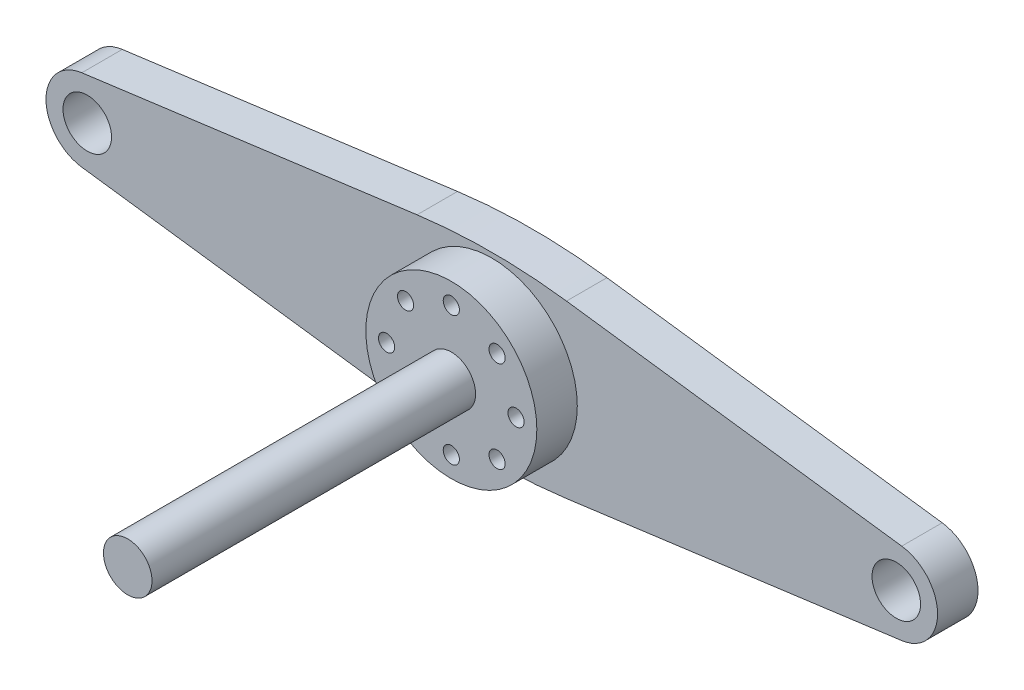
ISO-10303-21;
HEADER;
FILE_DESCRIPTION(('STEP AP214'),'2;1');
FILE_NAME('part.step','',(''),(''),'','','');
FILE_SCHEMA(('AUTOMOTIVE_DESIGN { 1 0 10303 214 1 1 1 1 }'));
ENDSEC;
DATA;
#1=APPLICATION_CONTEXT('core data for automotive mechanical design processes');
#2=APPLICATION_PROTOCOL_DEFINITION('international standard','automotive_design',2000,#1);
#3=PRODUCT_CONTEXT('',#1,'mechanical');
#4=PRODUCT('Part','Part','',(#3));
#5=PRODUCT_RELATED_PRODUCT_CATEGORY('part','',(#4));
#6=PRODUCT_DEFINITION_FORMATION('','',#4);
#7=PRODUCT_DEFINITION_CONTEXT('part definition',#1,'design');
#8=PRODUCT_DEFINITION('design','',#6,#7);
#9=PRODUCT_DEFINITION_SHAPE('','',#8);
#10=(LENGTH_UNIT() NAMED_UNIT(*) SI_UNIT(.MILLI.,.METRE.));
#11=(NAMED_UNIT(*) PLANE_ANGLE_UNIT() SI_UNIT($,.RADIAN.));
#12=(NAMED_UNIT(*) SI_UNIT($,.STERADIAN.) SOLID_ANGLE_UNIT());
#13=UNCERTAINTY_MEASURE_WITH_UNIT(LENGTH_MEASURE(1.E-05),#10,'distance_accuracy_value','');
#14=(GEOMETRIC_REPRESENTATION_CONTEXT(3) GLOBAL_UNCERTAINTY_ASSIGNED_CONTEXT((#13)) GLOBAL_UNIT_ASSIGNED_CONTEXT((#10,
#11,#12)) REPRESENTATION_CONTEXT('',''));
#15=CARTESIAN_POINT('',(0.,0.,0.));
#16=DIRECTION('',(0.,0.,1.));
#17=DIRECTION('',(1.,0.,0.));
#18=AXIS2_PLACEMENT_3D('',#15,#16,#17);
#19=CARTESIAN_POINT('',(-5.65685424949245,-5.65685424949231,5.));
#20=DIRECTION('',(0.,0.,-1.));
#21=DIRECTION('',(-1.,0.,0.));
#22=AXIS2_PLACEMENT_3D('',#19,#20,#21);
#23=CYLINDRICAL_SURFACE('',#22,1.);
#24=CARTESIAN_POINT('',(-5.65685424949245,-5.65685424949231,0.));
#25=DIRECTION('',(0.,0.,1.));
#26=DIRECTION('',(1.,0.,0.));
#27=AXIS2_PLACEMENT_3D('',#24,#25,#26);
#28=CIRCLE('',#27,1.);
#29=CARTESIAN_POINT('',(-4.65685424949245,-5.65685424949231,0.));
#30=VERTEX_POINT('',#29);
#31=EDGE_CURVE('E204',#30,#30,#28,.T.);
#32=ORIENTED_EDGE('',*,*,#31,.F.);
#33=EDGE_LOOP('',(#32));
#34=FACE_BOUND('',#33,.T.);
#35=CARTESIAN_POINT('',(-5.65685424949245,-5.65685424949231,10.));
#36=DIRECTION('',(0.,0.,1.));
#37=DIRECTION('',(1.,0.,0.));
#38=AXIS2_PLACEMENT_3D('',#35,#36,#37);
#39=CIRCLE('',#38,1.);
#40=CARTESIAN_POINT('',(-4.65685424949245,-5.65685424949231,10.));
#41=VERTEX_POINT('',#40);
#42=EDGE_CURVE('E247',#41,#41,#39,.T.);
#43=ORIENTED_EDGE('',*,*,#42,.T.);
#44=EDGE_LOOP('',(#43));
#45=FACE_BOUND('',#44,.T.);
#46=ADVANCED_FACE('F61',(#34,#45),#23,.F.);
#47=CARTESIAN_POINT('',(0.,-8.,5.));
#48=DIRECTION('',(0.,0.,-1.));
#49=DIRECTION('',(-1.,0.,0.));
#50=AXIS2_PLACEMENT_3D('',#47,#48,#49);
#51=CYLINDRICAL_SURFACE('',#50,1.);
#52=CARTESIAN_POINT('',(0.,-8.,0.));
#53=DIRECTION('',(0.,0.,1.));
#54=DIRECTION('',(1.,0.,0.));
#55=AXIS2_PLACEMENT_3D('',#52,#53,#54);
#56=CIRCLE('',#55,1.);
#57=CARTESIAN_POINT('',(0.999999999999915,-8.,0.));
#58=VERTEX_POINT('',#57);
#59=EDGE_CURVE('E201',#58,#58,#56,.T.);
#60=ORIENTED_EDGE('',*,*,#59,.F.);
#61=EDGE_LOOP('',(#60));
#62=FACE_BOUND('',#61,.T.);
#63=CARTESIAN_POINT('',(0.,-8.,10.));
#64=DIRECTION('',(0.,0.,1.));
#65=DIRECTION('',(1.,0.,0.));
#66=AXIS2_PLACEMENT_3D('',#63,#64,#65);
#67=CIRCLE('',#66,1.);
#68=CARTESIAN_POINT('',(0.999999999999915,-8.,10.));
#69=VERTEX_POINT('',#68);
#70=EDGE_CURVE('E250',#69,#69,#67,.T.);
#71=ORIENTED_EDGE('',*,*,#70,.T.);
#72=EDGE_LOOP('',(#71));
#73=FACE_BOUND('',#72,.T.);
#74=ADVANCED_FACE('F294',(#62,#73),#51,.F.);
#75=CARTESIAN_POINT('',(5.65685424949233,-5.65685424949243,5.));
#76=DIRECTION('',(0.,0.,-1.));
#77=DIRECTION('',(-1.,0.,0.));
#78=AXIS2_PLACEMENT_3D('',#75,#76,#77);
#79=CYLINDRICAL_SURFACE('',#78,1.);
#80=CARTESIAN_POINT('',(5.65685424949233,-5.65685424949243,0.));
#81=DIRECTION('',(0.,0.,1.));
#82=DIRECTION('',(1.,0.,0.));
#83=AXIS2_PLACEMENT_3D('',#80,#81,#82);
#84=CIRCLE('',#83,1.);
#85=CARTESIAN_POINT('',(6.65685424949233,-5.65685424949243,0.));
#86=VERTEX_POINT('',#85);
#87=EDGE_CURVE('E198',#86,#86,#84,.T.);
#88=ORIENTED_EDGE('',*,*,#87,.F.);
#89=EDGE_LOOP('',(#88));
#90=FACE_BOUND('',#89,.T.);
#91=CARTESIAN_POINT('',(5.65685424949233,-5.65685424949243,10.));
#92=DIRECTION('',(0.,0.,1.));
#93=DIRECTION('',(1.,0.,0.));
#94=AXIS2_PLACEMENT_3D('',#91,#92,#93);
#95=CIRCLE('',#94,1.);
#96=CARTESIAN_POINT('',(6.65685424949233,-5.65685424949243,10.));
#97=VERTEX_POINT('',#96);
#98=EDGE_CURVE('E253',#97,#97,#95,.T.);
#99=ORIENTED_EDGE('',*,*,#98,.T.);
#100=EDGE_LOOP('',(#99));
#101=FACE_BOUND('',#100,.T.);
#102=ADVANCED_FACE('F300',(#90,#101),#79,.F.);
#103=CARTESIAN_POINT('',(8.,0.,5.));
#104=DIRECTION('',(0.,0.,-1.));
#105=DIRECTION('',(-1.,0.,0.));
#106=AXIS2_PLACEMENT_3D('',#103,#104,#105);
#107=CYLINDRICAL_SURFACE('',#106,0.999999999999999);
#108=CARTESIAN_POINT('',(8.,0.,0.));
#109=DIRECTION('',(0.,0.,1.));
#110=DIRECTION('',(1.,0.,0.));
#111=AXIS2_PLACEMENT_3D('',#108,#109,#110);
#112=CIRCLE('',#111,0.999999999999999);
#113=CARTESIAN_POINT('',(9.,0.,0.));
#114=VERTEX_POINT('',#113);
#115=EDGE_CURVE('E195',#114,#114,#112,.T.);
#116=ORIENTED_EDGE('',*,*,#115,.F.);
#117=EDGE_LOOP('',(#116));
#118=FACE_BOUND('',#117,.T.);
#119=CARTESIAN_POINT('',(8.,0.,10.));
#120=DIRECTION('',(0.,0.,1.));
#121=DIRECTION('',(1.,0.,0.));
#122=AXIS2_PLACEMENT_3D('',#119,#120,#121);
#123=CIRCLE('',#122,0.999999999999999);
#124=CARTESIAN_POINT('',(9.,0.,10.));
#125=VERTEX_POINT('',#124);
#126=EDGE_CURVE('E256',#125,#125,#123,.T.);
#127=ORIENTED_EDGE('',*,*,#126,.T.);
#128=EDGE_LOOP('',(#127));
#129=FACE_BOUND('',#128,.T.);
#130=ADVANCED_FACE('F310',(#118,#129),#107,.F.);
#131=CARTESIAN_POINT('',(5.65685424949241,5.65685424949235,5.));
#132=DIRECTION('',(0.,0.,-1.));
#133=DIRECTION('',(-1.,0.,0.));
#134=AXIS2_PLACEMENT_3D('',#131,#132,#133);
#135=CYLINDRICAL_SURFACE('',#134,0.999999999999999);
#136=CARTESIAN_POINT('',(5.65685424949241,5.65685424949235,0.));
#137=DIRECTION('',(0.,0.,1.));
#138=DIRECTION('',(1.,0.,0.));
#139=AXIS2_PLACEMENT_3D('',#136,#137,#138);
#140=CIRCLE('',#139,0.999999999999999);
#141=CARTESIAN_POINT('',(6.65685424949241,5.65685424949235,0.));
#142=VERTEX_POINT('',#141);
#143=EDGE_CURVE('E192',#142,#142,#140,.T.);
#144=ORIENTED_EDGE('',*,*,#143,.F.);
#145=EDGE_LOOP('',(#144));
#146=FACE_BOUND('',#145,.T.);
#147=CARTESIAN_POINT('',(5.65685424949241,5.65685424949235,10.));
#148=DIRECTION('',(0.,0.,1.));
#149=DIRECTION('',(1.,0.,0.));
#150=AXIS2_PLACEMENT_3D('',#147,#148,#149);
#151=CIRCLE('',#150,0.999999999999999);
#152=CARTESIAN_POINT('',(6.65685424949241,5.65685424949235,10.));
#153=VERTEX_POINT('',#152);
#154=EDGE_CURVE('E259',#153,#153,#151,.T.);
#155=ORIENTED_EDGE('',*,*,#154,.T.);
#156=EDGE_LOOP('',(#155));
#157=FACE_BOUND('',#156,.T.);
#158=ADVANCED_FACE('F314',(#146,#157),#135,.F.);
#159=CARTESIAN_POINT('',(0.,8.,5.));
#160=DIRECTION('',(0.,0.,-1.));
#161=DIRECTION('',(-1.,0.,0.));
#162=AXIS2_PLACEMENT_3D('',#159,#160,#161);
#163=CYLINDRICAL_SURFACE('',#162,1.);
#164=CARTESIAN_POINT('',(0.,8.,0.));
#165=DIRECTION('',(0.,0.,1.));
#166=DIRECTION('',(1.,0.,0.));
#167=AXIS2_PLACEMENT_3D('',#164,#165,#166);
#168=CIRCLE('',#167,1.);
#169=CARTESIAN_POINT('',(1.00000000000003,8.,0.));
#170=VERTEX_POINT('',#169);
#171=EDGE_CURVE('E189',#170,#170,#168,.T.);
#172=ORIENTED_EDGE('',*,*,#171,.F.);
#173=EDGE_LOOP('',(#172));
#174=FACE_BOUND('',#173,.T.);
#175=CARTESIAN_POINT('',(0.,8.,10.));
#176=DIRECTION('',(0.,0.,1.));
#177=DIRECTION('',(1.,0.,0.));
#178=AXIS2_PLACEMENT_3D('',#175,#176,#177);
#179=CIRCLE('',#178,1.);
#180=CARTESIAN_POINT('',(1.00000000000003,8.,10.));
#181=VERTEX_POINT('',#180);
#182=EDGE_CURVE('E262',#181,#181,#179,.T.);
#183=ORIENTED_EDGE('',*,*,#182,.T.);
#184=EDGE_LOOP('',(#183));
#185=FACE_BOUND('',#184,.T.);
#186=ADVANCED_FACE('F318',(#174,#185),#163,.F.);
#187=CARTESIAN_POINT('',(-8.,0.,5.));
#188=DIRECTION('',(0.,0.,-1.));
#189=DIRECTION('',(-1.,0.,0.));
#190=AXIS2_PLACEMENT_3D('',#187,#188,#189);
#191=CYLINDRICAL_SURFACE('',#190,1.);
#192=CARTESIAN_POINT('',(-8.,0.,0.));
#193=DIRECTION('',(0.,0.,1.));
#194=DIRECTION('',(1.,0.,0.));
#195=AXIS2_PLACEMENT_3D('',#192,#193,#194);
#196=CIRCLE('',#195,1.);
#197=CARTESIAN_POINT('',(-7.,0.,0.));
#198=VERTEX_POINT('',#197);
#199=EDGE_CURVE('E186',#198,#198,#196,.T.);
#200=ORIENTED_EDGE('',*,*,#199,.F.);
#201=EDGE_LOOP('',(#200));
#202=FACE_BOUND('',#201,.T.);
#203=CARTESIAN_POINT('',(-8.,0.,10.));
#204=DIRECTION('',(0.,0.,1.));
#205=DIRECTION('',(1.,0.,0.));
#206=AXIS2_PLACEMENT_3D('',#203,#204,#205);
#207=CIRCLE('',#206,1.);
#208=CARTESIAN_POINT('',(-7.,0.,10.));
#209=VERTEX_POINT('',#208);
#210=EDGE_CURVE('E265',#209,#209,#207,.T.);
#211=ORIENTED_EDGE('',*,*,#210,.T.);
#212=EDGE_LOOP('',(#211));
#213=FACE_BOUND('',#212,.T.);
#214=ADVANCED_FACE('F322',(#202,#213),#191,.F.);
#215=CARTESIAN_POINT('',(-5.65685424949237,5.65685424949239,5.));
#216=DIRECTION('',(0.,0.,-1.));
#217=DIRECTION('',(-1.,0.,0.));
#218=AXIS2_PLACEMENT_3D('',#215,#216,#217);
#219=CYLINDRICAL_SURFACE('',#218,0.999999999999999);
#220=CARTESIAN_POINT('',(-5.65685424949237,5.65685424949239,0.));
#221=DIRECTION('',(0.,0.,1.));
#222=DIRECTION('',(1.,0.,0.));
#223=AXIS2_PLACEMENT_3D('',#220,#221,#222);
#224=CIRCLE('',#223,0.999999999999999);
#225=CARTESIAN_POINT('',(-4.65685424949237,5.65685424949239,0.));
#226=VERTEX_POINT('',#225);
#227=EDGE_CURVE('E183',#226,#226,#224,.T.);
#228=ORIENTED_EDGE('',*,*,#227,.F.);
#229=EDGE_LOOP('',(#228));
#230=FACE_BOUND('',#229,.T.);
#231=CARTESIAN_POINT('',(-5.65685424949237,5.65685424949239,10.));
#232=DIRECTION('',(0.,0.,1.));
#233=DIRECTION('',(1.,0.,0.));
#234=AXIS2_PLACEMENT_3D('',#231,#232,#233);
#235=CIRCLE('',#234,0.999999999999999);
#236=CARTESIAN_POINT('',(-4.65685424949237,5.65685424949239,10.));
#237=VERTEX_POINT('',#236);
#238=EDGE_CURVE('E268',#237,#237,#235,.T.);
#239=ORIENTED_EDGE('',*,*,#238,.T.);
#240=EDGE_LOOP('',(#239));
#241=FACE_BOUND('',#240,.T.);
#242=ADVANCED_FACE('F326',(#230,#241),#219,.F.);
#243=CARTESIAN_POINT('',(0.,58.8173671567806,5.));
#244=DIRECTION('',(0.,0.,-1.));
#245=DIRECTION('',(-1.,0.,0.));
#246=AXIS2_PLACEMENT_3D('',#243,#244,#245);
#247=CYLINDRICAL_SURFACE('',#246,70.);
#248=CARTESIAN_POINT('',(0.,58.8173671567806,0.));
#249=DIRECTION('',(0.,0.,1.));
#250=DIRECTION('',(1.,0.,0.));
#251=AXIS2_PLACEMENT_3D('',#248,#249,#250);
#252=CIRCLE('',#251,70.);
#253=CARTESIAN_POINT('',(-9.23511167640649,-10.5707637614413,0.));
#254=VERTEX_POINT('',#253);
#255=CARTESIAN_POINT('',(9.23511167640649,-10.5707637614413,0.));
#256=VERTEX_POINT('',#255);
#257=EDGE_CURVE('E167',#254,#256,#252,.T.);
#258=ORIENTED_EDGE('',*,*,#257,.T.);
#259=DIRECTION('',(0.,0.,-1.));
#260=VECTOR('',#259,1.);
#261=CARTESIAN_POINT('',(9.23511167640649,-10.5707637614413,5.));
#262=LINE('',#261,#260);
#263=CARTESIAN_POINT('',(9.23511167640649,-10.5707637614413,5.));
#264=VERTEX_POINT('',#263);
#265=EDGE_CURVE('E71',#264,#256,#262,.T.);
#266=ORIENTED_EDGE('',*,*,#265,.F.);
#267=CARTESIAN_POINT('',(0.,58.8173671567806,5.));
#268=DIRECTION('',(0.,0.,1.));
#269=DIRECTION('',(1.,0.,0.));
#270=AXIS2_PLACEMENT_3D('',#267,#268,#269);
#271=CIRCLE('',#270,70.);
#272=CARTESIAN_POINT('',(-9.23511167640649,-10.5707637614413,5.));
#273=VERTEX_POINT('',#272);
#274=EDGE_CURVE('E118',#273,#264,#271,.T.);
#275=ORIENTED_EDGE('',*,*,#274,.F.);
#276=DIRECTION('',(0.,0.,-1.));
#277=VECTOR('',#276,1.);
#278=CARTESIAN_POINT('',(-9.23511167640649,-10.5707637614413,5.));
#279=LINE('',#278,#277);
#280=EDGE_CURVE('E12',#273,#254,#279,.T.);
#281=ORIENTED_EDGE('',*,*,#280,.T.);
#282=EDGE_LOOP('',(#258,#266,#275,#281));
#283=FACE_BOUND('',#282,.T.);
#284=ADVANCED_FACE('F221',(#283),#247,.T.);
#285=CARTESIAN_POINT('',(1.54315479575544,-11.5945134987938,5.));
#286=DIRECTION('',(0.131930166805804,-0.991259013117456,0.));
#287=DIRECTION('',(0.991259013117456,0.131930166805804,0.));
#288=AXIS2_PLACEMENT_3D('',#285,#286,#287);
#289=PLANE('',#288);
#290=DIRECTION('',(-0.991259013117456,-0.131930166805804,0.));
#291=VECTOR('',#290,1.);
#292=CARTESIAN_POINT('',(1.54315479575544,-11.5945134987938,0.));
#293=LINE('',#292,#291);
#294=CARTESIAN_POINT('',(50.6728763500851,-5.05566515137672,0.));
#295=VERTEX_POINT('',#294);
#296=EDGE_CURVE('E170',#295,#256,#293,.T.);
#297=ORIENTED_EDGE('',*,*,#296,.F.);
#298=DIRECTION('',(0.,0.,-1.));
#299=VECTOR('',#298,1.);
#300=CARTESIAN_POINT('',(50.6728763500851,-5.05566515137672,5.));
#301=LINE('',#300,#299);
#302=CARTESIAN_POINT('',(50.6728763500851,-5.05566515137672,5.));
#303=VERTEX_POINT('',#302);
#304=EDGE_CURVE('E213',#303,#295,#301,.T.);
#305=ORIENTED_EDGE('',*,*,#304,.F.);
#306=DIRECTION('',(-0.991259013117456,-0.131930166805804,0.));
#307=VECTOR('',#306,1.);
#308=CARTESIAN_POINT('',(1.54315479575544,-11.5945134987938,5.));
#309=LINE('',#308,#307);
#310=EDGE_CURVE('E220',#303,#264,#309,.T.);
#311=ORIENTED_EDGE('',*,*,#310,.T.);
#312=ORIENTED_EDGE('',*,*,#265,.T.);
#313=EDGE_LOOP('',(#297,#305,#311,#312));
#314=FACE_BOUND('',#313,.T.);
#315=ADVANCED_FACE('F218',(#314),#289,.T.);
#316=CARTESIAN_POINT('',(50.,0.,5.));
#317=DIRECTION('',(0.,0.,-1.));
#318=DIRECTION('',(-1.,0.,0.));
#319=AXIS2_PLACEMENT_3D('',#316,#317,#318);
#320=CYLINDRICAL_SURFACE('',#319,5.10024633771241);
#321=CARTESIAN_POINT('',(50.,0.,0.));
#322=DIRECTION('',(0.,0.,1.));
#323=DIRECTION('',(1.,0.,0.));
#324=AXIS2_PLACEMENT_3D('',#321,#322,#323);
#325=CIRCLE('',#324,5.10024633771241);
#326=CARTESIAN_POINT('',(50.6728763500851,5.05566515137672,0.));
#327=VERTEX_POINT('',#326);
#328=EDGE_CURVE('E173',#327,#295,#325,.F.);
#329=ORIENTED_EDGE('',*,*,#328,.F.);
#330=DIRECTION('',(0.,0.,-1.));
#331=VECTOR('',#330,1.);
#332=CARTESIAN_POINT('',(50.6728763500851,5.05566515137672,5.));
#333=LINE('',#332,#331);
#334=CARTESIAN_POINT('',(50.6728763500851,5.05566515137672,5.));
#335=VERTEX_POINT('',#334);
#336=EDGE_CURVE('E211',#335,#327,#333,.T.);
#337=ORIENTED_EDGE('',*,*,#336,.F.);
#338=CARTESIAN_POINT('',(50.,0.,5.));
#339=DIRECTION('',(0.,0.,1.));
#340=DIRECTION('',(1.,0.,0.));
#341=AXIS2_PLACEMENT_3D('',#338,#339,#340);
#342=CIRCLE('',#341,5.10024633771241);
#343=EDGE_CURVE('E232',#335,#303,#342,.F.);
#344=ORIENTED_EDGE('',*,*,#343,.T.);
#345=ORIENTED_EDGE('',*,*,#304,.T.);
#346=EDGE_LOOP('',(#329,#337,#344,#345));
#347=FACE_BOUND('',#346,.T.);
#348=ADVANCED_FACE('F230',(#347),#320,.T.);
#349=CARTESIAN_POINT('',(1.54315479575544,11.5945134987938,5.));
#350=DIRECTION('',(-0.131930166805804,-0.991259013117456,0.));
#351=DIRECTION('',(0.991259013117456,-0.131930166805804,0.));
#352=AXIS2_PLACEMENT_3D('',#349,#350,#351);
#353=PLANE('',#352);
#354=DIRECTION('',(-0.991259013117456,0.131930166805804,0.));
#355=VECTOR('',#354,1.);
#356=CARTESIAN_POINT('',(1.54315479575544,11.5945134987938,0.));
#357=LINE('',#356,#355);
#358=CARTESIAN_POINT('',(9.23511167640649,10.5707637614413,0.));
#359=VERTEX_POINT('',#358);
#360=EDGE_CURVE('E176',#327,#359,#357,.T.);
#361=ORIENTED_EDGE('',*,*,#360,.T.);
#362=DIRECTION('',(0.,0.,-1.));
#363=VECTOR('',#362,1.);
#364=CARTESIAN_POINT('',(9.23511167640649,10.5707637614413,5.));
#365=LINE('',#364,#363);
#366=CARTESIAN_POINT('',(9.23511167640649,10.5707637614413,5.));
#367=VERTEX_POINT('',#366);
#368=EDGE_CURVE('E143',#367,#359,#365,.T.);
#369=ORIENTED_EDGE('',*,*,#368,.F.);
#370=DIRECTION('',(-0.991259013117456,0.131930166805804,0.));
#371=VECTOR('',#370,1.);
#372=CARTESIAN_POINT('',(1.54315479575544,11.5945134987938,5.));
#373=LINE('',#372,#371);
#374=EDGE_CURVE('E149',#335,#367,#373,.T.);
#375=ORIENTED_EDGE('',*,*,#374,.F.);
#376=ORIENTED_EDGE('',*,*,#336,.T.);
#377=EDGE_LOOP('',(#361,#369,#375,#376));
#378=FACE_BOUND('',#377,.T.);
#379=ADVANCED_FACE('F339',(#378),#353,.F.);
#380=CARTESIAN_POINT('',(0.,-58.8173671567806,5.));
#381=DIRECTION('',(0.,0.,-1.));
#382=DIRECTION('',(-1.,0.,0.));
#383=AXIS2_PLACEMENT_3D('',#380,#381,#382);
#384=CYLINDRICAL_SURFACE('',#383,70.);
#385=CARTESIAN_POINT('',(0.,-58.8173671567806,0.));
#386=DIRECTION('',(0.,0.,1.));
#387=DIRECTION('',(1.,0.,0.));
#388=AXIS2_PLACEMENT_3D('',#385,#386,#387);
#389=CIRCLE('',#388,70.);
#390=CARTESIAN_POINT('',(-9.23511167640649,10.5707637614413,0.));
#391=VERTEX_POINT('',#390);
#392=EDGE_CURVE('E138',#391,#359,#389,.F.);
#393=ORIENTED_EDGE('',*,*,#392,.F.);
#394=DIRECTION('',(0.,0.,-1.));
#395=VECTOR('',#394,1.);
#396=CARTESIAN_POINT('',(-9.23511167640649,10.5707637614413,5.));
#397=LINE('',#396,#395);
#398=CARTESIAN_POINT('',(-9.23511167640649,10.5707637614413,5.));
#399=VERTEX_POINT('',#398);
#400=EDGE_CURVE('E133',#399,#391,#397,.T.);
#401=ORIENTED_EDGE('',*,*,#400,.F.);
#402=CARTESIAN_POINT('',(0.,-58.8173671567806,5.));
#403=DIRECTION('',(0.,0.,1.));
#404=DIRECTION('',(1.,0.,0.));
#405=AXIS2_PLACEMENT_3D('',#402,#403,#404);
#406=CIRCLE('',#405,70.);
#407=EDGE_CURVE('E136',#399,#367,#406,.F.);
#408=ORIENTED_EDGE('',*,*,#407,.T.);
#409=ORIENTED_EDGE('',*,*,#368,.T.);
#410=EDGE_LOOP('',(#393,#401,#408,#409));
#411=FACE_BOUND('',#410,.T.);
#412=ADVANCED_FACE('F135',(#411),#384,.T.);
#413=CARTESIAN_POINT('',(-1.54315479575544,11.5945134987938,5.));
#414=DIRECTION('',(-0.131930166805804,0.991259013117456,0.));
#415=DIRECTION('',(-0.991259013117456,-0.131930166805804,0.));
#416=AXIS2_PLACEMENT_3D('',#413,#414,#415);
#417=PLANE('',#416);
#418=DIRECTION('',(0.991259013117456,0.131930166805804,0.));
#419=VECTOR('',#418,1.);
#420=CARTESIAN_POINT('',(-1.54315479575544,11.5945134987938,0.));
#421=LINE('',#420,#419);
#422=CARTESIAN_POINT('',(-50.6728763500851,5.05566515137672,0.));
#423=VERTEX_POINT('',#422);
#424=EDGE_CURVE('E180',#423,#391,#421,.T.);
#425=ORIENTED_EDGE('',*,*,#424,.F.);
#426=DIRECTION('',(0.,0.,-1.));
#427=VECTOR('',#426,1.);
#428=CARTESIAN_POINT('',(-50.6728763500851,5.05566515137672,5.));
#429=LINE('',#428,#427);
#430=CARTESIAN_POINT('',(-50.6728763500851,5.05566515137672,5.));
#431=VERTEX_POINT('',#430);
#432=EDGE_CURVE('E107',#431,#423,#429,.T.);
#433=ORIENTED_EDGE('',*,*,#432,.F.);
#434=DIRECTION('',(0.991259013117456,0.131930166805804,0.));
#435=VECTOR('',#434,1.);
#436=CARTESIAN_POINT('',(-1.54315479575544,11.5945134987938,5.));
#437=LINE('',#436,#435);
#438=EDGE_CURVE('E146',#431,#399,#437,.T.);
#439=ORIENTED_EDGE('',*,*,#438,.T.);
#440=ORIENTED_EDGE('',*,*,#400,.T.);
#441=EDGE_LOOP('',(#425,#433,#439,#440));
#442=FACE_BOUND('',#441,.T.);
#443=ADVANCED_FACE('F152',(#442),#417,.T.);
#444=CARTESIAN_POINT('',(-50.,0.,5.));
#445=DIRECTION('',(0.,0.,-1.));
#446=DIRECTION('',(-1.,0.,0.));
#447=AXIS2_PLACEMENT_3D('',#444,#445,#446);
#448=CYLINDRICAL_SURFACE('',#447,5.10024633771241);
#449=CARTESIAN_POINT('',(-50.,0.,0.));
#450=DIRECTION('',(0.,0.,1.));
#451=DIRECTION('',(1.,0.,0.));
#452=AXIS2_PLACEMENT_3D('',#449,#450,#451);
#453=CIRCLE('',#452,5.10024633771241);
#454=CARTESIAN_POINT('',(-50.6728763500851,-5.05566515137672,0.));
#455=VERTEX_POINT('',#454);
#456=EDGE_CURVE('E110',#423,#455,#453,.T.);
#457=ORIENTED_EDGE('',*,*,#456,.T.);
#458=DIRECTION('',(0.,0.,-1.));
#459=VECTOR('',#458,1.);
#460=CARTESIAN_POINT('',(-50.6728763500851,-5.05566515137672,5.));
#461=LINE('',#460,#459);
#462=CARTESIAN_POINT('',(-50.6728763500851,-5.05566515137672,5.));
#463=VERTEX_POINT('',#462);
#464=EDGE_CURVE('E154',#463,#455,#461,.T.);
#465=ORIENTED_EDGE('',*,*,#464,.F.);
#466=CARTESIAN_POINT('',(-50.,0.,5.));
#467=DIRECTION('',(0.,0.,1.));
#468=DIRECTION('',(1.,0.,0.));
#469=AXIS2_PLACEMENT_3D('',#466,#467,#468);
#470=CIRCLE('',#469,5.10024633771241);
#471=EDGE_CURVE('E79',#431,#463,#470,.T.);
#472=ORIENTED_EDGE('',*,*,#471,.F.);
#473=ORIENTED_EDGE('',*,*,#432,.T.);
#474=EDGE_LOOP('',(#457,#465,#472,#473));
#475=FACE_BOUND('',#474,.T.);
#476=ADVANCED_FACE('F331',(#475),#448,.T.);
#477=CARTESIAN_POINT('',(-1.54315479575544,-11.5945134987938,5.));
#478=DIRECTION('',(0.131930166805804,0.991259013117456,0.));
#479=DIRECTION('',(-0.991259013117456,0.131930166805804,0.));
#480=AXIS2_PLACEMENT_3D('',#477,#478,#479);
#481=PLANE('',#480);
#482=DIRECTION('',(0.991259013117456,-0.131930166805804,0.));
#483=VECTOR('',#482,1.);
#484=CARTESIAN_POINT('',(-1.54315479575544,-11.5945134987938,0.));
#485=LINE('',#484,#483);
#486=EDGE_CURVE('E164',#455,#254,#485,.T.);
#487=ORIENTED_EDGE('',*,*,#486,.T.);
#488=ORIENTED_EDGE('',*,*,#280,.F.);
#489=DIRECTION('',(0.991259013117456,-0.131930166805804,0.));
#490=VECTOR('',#489,1.);
#491=CARTESIAN_POINT('',(-1.54315479575544,-11.5945134987938,5.));
#492=LINE('',#491,#490);
#493=EDGE_CURVE('E235',#463,#273,#492,.T.);
#494=ORIENTED_EDGE('',*,*,#493,.F.);
#495=ORIENTED_EDGE('',*,*,#464,.T.);
#496=EDGE_LOOP('',(#487,#488,#494,#495));
#497=FACE_BOUND('',#496,.T.);
#498=ADVANCED_FACE('F334',(#497),#481,.F.);
#499=CARTESIAN_POINT('',(-50.,0.,5.));
#500=DIRECTION('',(0.,0.,-1.));
#501=DIRECTION('',(-1.,0.,0.));
#502=AXIS2_PLACEMENT_3D('',#499,#500,#501);
#503=CYLINDRICAL_SURFACE('',#502,3.);
#504=CARTESIAN_POINT('',(-50.,0.,5.));
#505=DIRECTION('',(0.,0.,1.));
#506=DIRECTION('',(1.,0.,0.));
#507=AXIS2_PLACEMENT_3D('',#504,#505,#506);
#508=CIRCLE('',#507,3.);
#509=CARTESIAN_POINT('',(-47.,0.,5.));
#510=VERTEX_POINT('',#509);
#511=EDGE_CURVE('E239',#510,#510,#508,.T.);
#512=ORIENTED_EDGE('',*,*,#511,.T.);
#513=EDGE_LOOP('',(#512));
#514=FACE_BOUND('',#513,.T.);
#515=CARTESIAN_POINT('',(-50.,0.,0.));
#516=DIRECTION('',(0.,0.,1.));
#517=DIRECTION('',(1.,0.,0.));
#518=AXIS2_PLACEMENT_3D('',#515,#516,#517);
#519=CIRCLE('',#518,3.);
#520=CARTESIAN_POINT('',(-47.,0.,0.));
#521=VERTEX_POINT('',#520);
#522=EDGE_CURVE('E161',#521,#521,#519,.T.);
#523=ORIENTED_EDGE('',*,*,#522,.F.);
#524=EDGE_LOOP('',(#523));
#525=FACE_BOUND('',#524,.T.);
#526=ADVANCED_FACE('F350',(#514,#525),#503,.F.);
#527=CARTESIAN_POINT('',(50.,0.,5.));
#528=DIRECTION('',(0.,0.,-1.));
#529=DIRECTION('',(-1.,0.,0.));
#530=AXIS2_PLACEMENT_3D('',#527,#528,#529);
#531=CYLINDRICAL_SURFACE('',#530,3.);
#532=CARTESIAN_POINT('',(50.,0.,5.));
#533=DIRECTION('',(0.,0.,1.));
#534=DIRECTION('',(1.,0.,0.));
#535=AXIS2_PLACEMENT_3D('',#532,#533,#534);
#536=CIRCLE('',#535,3.);
#537=CARTESIAN_POINT('',(53.,0.,5.));
#538=VERTEX_POINT('',#537);
#539=EDGE_CURVE('E207',#538,#538,#536,.F.);
#540=ORIENTED_EDGE('',*,*,#539,.F.);
#541=EDGE_LOOP('',(#540));
#542=FACE_BOUND('',#541,.T.);
#543=CARTESIAN_POINT('',(50.,0.,0.));
#544=DIRECTION('',(0.,0.,1.));
#545=DIRECTION('',(1.,0.,0.));
#546=AXIS2_PLACEMENT_3D('',#543,#544,#545);
#547=CIRCLE('',#546,3.);
#548=CARTESIAN_POINT('',(53.,0.,0.));
#549=VERTEX_POINT('',#548);
#550=EDGE_CURVE('E158',#549,#549,#547,.F.);
#551=ORIENTED_EDGE('',*,*,#550,.T.);
#552=EDGE_LOOP('',(#551));
#553=FACE_BOUND('',#552,.T.);
#554=ADVANCED_FACE('F63',(#542,#553),#531,.F.);
#555=CARTESIAN_POINT('',(0.,0.,0.));
#556=DIRECTION('',(0.,0.,1.));
#557=DIRECTION('',(1.,0.,0.));
#558=AXIS2_PLACEMENT_3D('',#555,#556,#557);
#559=PLANE('',#558);
#560=ORIENTED_EDGE('',*,*,#550,.F.);
#561=EDGE_LOOP('',(#560));
#562=FACE_BOUND('',#561,.T.);
#563=ORIENTED_EDGE('',*,*,#522,.T.);
#564=EDGE_LOOP('',(#563));
#565=FACE_BOUND('',#564,.T.);
#566=ORIENTED_EDGE('',*,*,#486,.F.);
#567=ORIENTED_EDGE('',*,*,#456,.F.);
#568=ORIENTED_EDGE('',*,*,#424,.T.);
#569=ORIENTED_EDGE('',*,*,#392,.T.);
#570=ORIENTED_EDGE('',*,*,#360,.F.);
#571=ORIENTED_EDGE('',*,*,#328,.T.);
#572=ORIENTED_EDGE('',*,*,#296,.T.);
#573=ORIENTED_EDGE('',*,*,#257,.F.);
#574=EDGE_LOOP('',(#566,#567,#568,#569,#570,#571,#572,#573));
#575=FACE_BOUND('',#574,.T.);
#576=ORIENTED_EDGE('',*,*,#31,.T.);
#577=EDGE_LOOP('',(#576));
#578=FACE_BOUND('',#577,.T.);
#579=ORIENTED_EDGE('',*,*,#59,.T.);
#580=EDGE_LOOP('',(#579));
#581=FACE_BOUND('',#580,.T.);
#582=ORIENTED_EDGE('',*,*,#87,.T.);
#583=EDGE_LOOP('',(#582));
#584=FACE_BOUND('',#583,.T.);
#585=ORIENTED_EDGE('',*,*,#115,.T.);
#586=EDGE_LOOP('',(#585));
#587=FACE_BOUND('',#586,.T.);
#588=ORIENTED_EDGE('',*,*,#143,.T.);
#589=EDGE_LOOP('',(#588));
#590=FACE_BOUND('',#589,.T.);
#591=ORIENTED_EDGE('',*,*,#171,.T.);
#592=EDGE_LOOP('',(#591));
#593=FACE_BOUND('',#592,.T.);
#594=ORIENTED_EDGE('',*,*,#199,.T.);
#595=EDGE_LOOP('',(#594));
#596=FACE_BOUND('',#595,.T.);
#597=ORIENTED_EDGE('',*,*,#227,.T.);
#598=EDGE_LOOP('',(#597));
#599=FACE_BOUND('',#598,.T.);
#600=ADVANCED_FACE('F225',(#562,#565,#575,#578,#581,#584,#587,#590,#593,#596,#599),#559,.F.);
#601=CARTESIAN_POINT('',(0.,0.,5.));
#602=DIRECTION('',(0.,0.,1.));
#603=DIRECTION('',(1.,0.,0.));
#604=AXIS2_PLACEMENT_3D('',#601,#602,#603);
#605=PLANE('',#604);
#606=CARTESIAN_POINT('',(0.,0.,5.));
#607=DIRECTION('',(0.,0.,1.));
#608=DIRECTION('',(1.,0.,0.));
#609=AXIS2_PLACEMENT_3D('',#606,#607,#608);
#610=CIRCLE('',#609,10.5707637614413);
#611=CARTESIAN_POINT('',(10.5707637614413,0.,5.));
#612=VERTEX_POINT('',#611);
#613=EDGE_CURVE('E65',#612,#612,#610,.F.);
#614=ORIENTED_EDGE('',*,*,#613,.T.);
#615=EDGE_LOOP('',(#614));
#616=FACE_BOUND('',#615,.T.);
#617=ORIENTED_EDGE('',*,*,#539,.T.);
#618=EDGE_LOOP('',(#617));
#619=FACE_BOUND('',#618,.T.);
#620=ORIENTED_EDGE('',*,*,#511,.F.);
#621=EDGE_LOOP('',(#620));
#622=FACE_BOUND('',#621,.T.);
#623=ORIENTED_EDGE('',*,*,#493,.T.);
#624=ORIENTED_EDGE('',*,*,#274,.T.);
#625=ORIENTED_EDGE('',*,*,#310,.F.);
#626=ORIENTED_EDGE('',*,*,#343,.F.);
#627=ORIENTED_EDGE('',*,*,#374,.T.);
#628=ORIENTED_EDGE('',*,*,#407,.F.);
#629=ORIENTED_EDGE('',*,*,#438,.F.);
#630=ORIENTED_EDGE('',*,*,#471,.T.);
#631=EDGE_LOOP('',(#623,#624,#625,#626,#627,#628,#629,#630));
#632=FACE_BOUND('',#631,.T.);
#633=ADVANCED_FACE('F145',(#616,#619,#622,#632),#605,.T.);
#634=CARTESIAN_POINT('',(0.,0.,10.));
#635=DIRECTION('',(0.,0.,-1.));
#636=DIRECTION('',(-1.,0.,0.));
#637=AXIS2_PLACEMENT_3D('',#634,#635,#636);
#638=CYLINDRICAL_SURFACE('',#637,10.5707637614413);
#639=ORIENTED_EDGE('',*,*,#613,.F.);
#640=EDGE_LOOP('',(#639));
#641=FACE_BOUND('',#640,.T.);
#642=CARTESIAN_POINT('',(0.,0.,10.));
#643=DIRECTION('',(0.,0.,1.));
#644=DIRECTION('',(1.,0.,0.));
#645=AXIS2_PLACEMENT_3D('',#642,#643,#644);
#646=CIRCLE('',#645,10.5707637614413);
#647=CARTESIAN_POINT('',(10.5707637614413,0.,10.));
#648=VERTEX_POINT('',#647);
#649=EDGE_CURVE('E244',#648,#648,#646,.T.);
#650=ORIENTED_EDGE('',*,*,#649,.F.);
#651=EDGE_LOOP('',(#650));
#652=FACE_BOUND('',#651,.T.);
#653=ADVANCED_FACE('F290',(#641,#652),#638,.T.);
#654=CARTESIAN_POINT('',(0.,0.,10.));
#655=DIRECTION('',(0.,0.,1.));
#656=DIRECTION('',(1.,0.,0.));
#657=AXIS2_PLACEMENT_3D('',#654,#655,#656);
#658=PLANE('',#657);
#659=CARTESIAN_POINT('',(0.,0.,10.));
#660=DIRECTION('',(0.,0.,1.));
#661=DIRECTION('',(1.,0.,0.));
#662=AXIS2_PLACEMENT_3D('',#659,#660,#661);
#663=CIRCLE('',#662,3.);
#664=CARTESIAN_POINT('',(3.,0.,10.));
#665=VERTEX_POINT('',#664);
#666=EDGE_CURVE('E271',#665,#665,#663,.T.);
#667=ORIENTED_EDGE('',*,*,#666,.F.);
#668=EDGE_LOOP('',(#667));
#669=FACE_BOUND('',#668,.T.);
#670=ORIENTED_EDGE('',*,*,#238,.F.);
#671=EDGE_LOOP('',(#670));
#672=FACE_BOUND('',#671,.T.);
#673=ORIENTED_EDGE('',*,*,#210,.F.);
#674=EDGE_LOOP('',(#673));
#675=FACE_BOUND('',#674,.T.);
#676=ORIENTED_EDGE('',*,*,#182,.F.);
#677=EDGE_LOOP('',(#676));
#678=FACE_BOUND('',#677,.T.);
#679=ORIENTED_EDGE('',*,*,#154,.F.);
#680=EDGE_LOOP('',(#679));
#681=FACE_BOUND('',#680,.T.);
#682=ORIENTED_EDGE('',*,*,#126,.F.);
#683=EDGE_LOOP('',(#682));
#684=FACE_BOUND('',#683,.T.);
#685=ORIENTED_EDGE('',*,*,#98,.F.);
#686=EDGE_LOOP('',(#685));
#687=FACE_BOUND('',#686,.T.);
#688=ORIENTED_EDGE('',*,*,#70,.F.);
#689=EDGE_LOOP('',(#688));
#690=FACE_BOUND('',#689,.T.);
#691=ORIENTED_EDGE('',*,*,#42,.F.);
#692=EDGE_LOOP('',(#691));
#693=FACE_BOUND('',#692,.T.);
#694=ORIENTED_EDGE('',*,*,#649,.T.);
#695=EDGE_LOOP('',(#694));
#696=FACE_BOUND('',#695,.T.);
#697=ADVANCED_FACE('F282',(#669,#672,#675,#678,#681,#684,#687,#690,#693,#696),#658,.T.);
#698=CARTESIAN_POINT('',(0.,0.,50.));
#699=DIRECTION('',(0.,0.,-1.));
#700=DIRECTION('',(-1.,0.,0.));
#701=AXIS2_PLACEMENT_3D('',#698,#699,#700);
#702=CYLINDRICAL_SURFACE('',#701,3.);
#703=ORIENTED_EDGE('',*,*,#666,.T.);
#704=EDGE_LOOP('',(#703));
#705=FACE_BOUND('',#704,.T.);
#706=CARTESIAN_POINT('',(0.,0.,50.));
#707=DIRECTION('',(0.,0.,1.));
#708=DIRECTION('',(1.,0.,0.));
#709=AXIS2_PLACEMENT_3D('',#706,#707,#708);
#710=CIRCLE('',#709,3.);
#711=CARTESIAN_POINT('',(3.,0.,50.));
#712=VERTEX_POINT('',#711);
#713=EDGE_CURVE('E274',#712,#712,#710,.T.);
#714=ORIENTED_EDGE('',*,*,#713,.F.);
#715=EDGE_LOOP('',(#714));
#716=FACE_BOUND('',#715,.T.);
#717=ADVANCED_FACE('F280',(#705,#716),#702,.T.);
#718=CARTESIAN_POINT('',(0.,0.,50.));
#719=DIRECTION('',(0.,0.,1.));
#720=DIRECTION('',(1.,0.,0.));
#721=AXIS2_PLACEMENT_3D('',#718,#719,#720);
#722=PLANE('',#721);
#723=ORIENTED_EDGE('',*,*,#713,.T.);
#724=EDGE_LOOP('',(#723));
#725=FACE_BOUND('',#724,.T.);
#726=ADVANCED_FACE('F278',(#725),#722,.T.);
#727=CLOSED_SHELL('',(#46,#74,#102,#130,#158,#186,#214,#242,#284,#315,#348,#379,#412,#443,#476,
#498,#526,#554,#600,#633,#653,#697,#717,#726));
#728=MANIFOLD_SOLID_BREP('B2',#727);
#729=ADVANCED_BREP_SHAPE_REPRESENTATION('',(#18,#728),#14);
#730=SHAPE_DEFINITION_REPRESENTATION(#9,#729);
ENDSEC;
END-ISO-10303-21;
